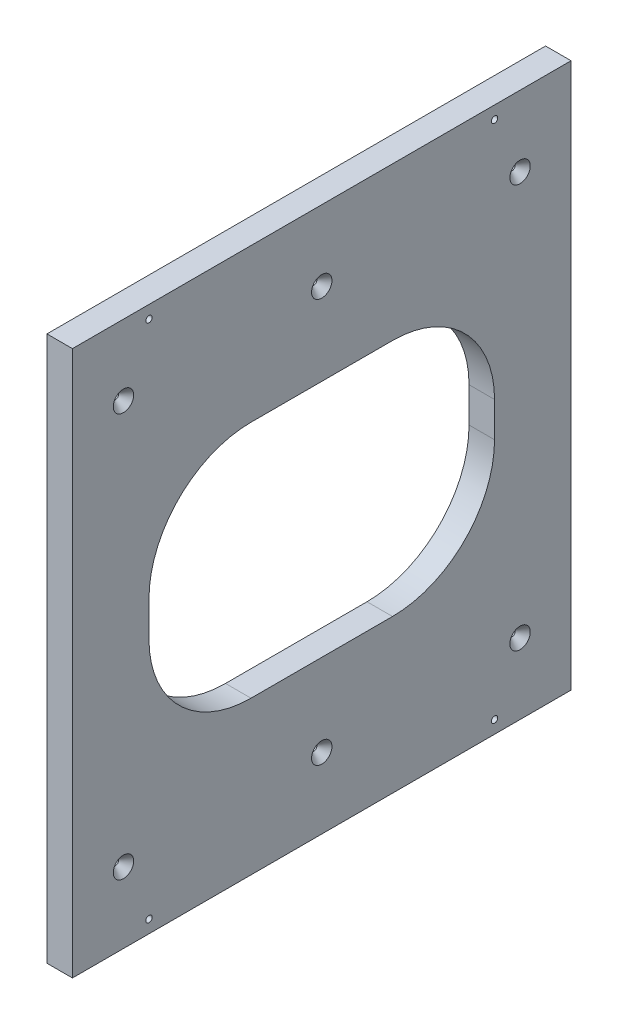
ISO-10303-21;
HEADER;
FILE_DESCRIPTION(('STEP AP214'),'2;1');
FILE_NAME('part.step','',(''),(''),'','','');
FILE_SCHEMA(('AUTOMOTIVE_DESIGN { 1 0 10303 214 1 1 1 1 }'));
ENDSEC;
DATA;
#1=APPLICATION_CONTEXT('core data for automotive mechanical design processes');
#2=APPLICATION_PROTOCOL_DEFINITION('international standard','automotive_design',2000,#1);
#3=PRODUCT_CONTEXT('',#1,'mechanical');
#4=PRODUCT('Part','Part','',(#3));
#5=PRODUCT_RELATED_PRODUCT_CATEGORY('part','',(#4));
#6=PRODUCT_DEFINITION_FORMATION('','',#4);
#7=PRODUCT_DEFINITION_CONTEXT('part definition',#1,'design');
#8=PRODUCT_DEFINITION('design','',#6,#7);
#9=PRODUCT_DEFINITION_SHAPE('','',#8);
#10=(LENGTH_UNIT() NAMED_UNIT(*) SI_UNIT(.MILLI.,.METRE.));
#11=(NAMED_UNIT(*) PLANE_ANGLE_UNIT() SI_UNIT($,.RADIAN.));
#12=(NAMED_UNIT(*) SI_UNIT($,.STERADIAN.) SOLID_ANGLE_UNIT());
#13=UNCERTAINTY_MEASURE_WITH_UNIT(LENGTH_MEASURE(1.E-05),#10,'distance_accuracy_value','');
#14=(GEOMETRIC_REPRESENTATION_CONTEXT(3) GLOBAL_UNCERTAINTY_ASSIGNED_CONTEXT((#13)) GLOBAL_UNIT_ASSIGNED_CONTEXT((#10,
#11,#12)) REPRESENTATION_CONTEXT('',''));
#15=CARTESIAN_POINT('',(0.,0.,0.));
#16=DIRECTION('',(0.,0.,1.));
#17=DIRECTION('',(1.,0.,0.));
#18=AXIS2_PLACEMENT_3D('',#15,#16,#17);
#19=CARTESIAN_POINT('',(-234.752967180651,82.8417413816962,538.962549777206));
#20=DIRECTION('',(1.,0.,0.));
#21=DIRECTION('',(0.,1.,0.));
#22=AXIS2_PLACEMENT_3D('',#19,#20,#21);
#23=PLANE('',#22);
#24=CARTESIAN_POINT('',(-234.752967180651,47.6249999999993,222.849999999992));
#25=DIRECTION('',(1.,0.,0.));
#26=DIRECTION('',(0.,1.,0.));
#27=AXIS2_PLACEMENT_3D('',#24,#25,#26);
#28=CIRCLE('',#27,1.5875);
#29=CARTESIAN_POINT('',(-234.752967180651,49.2124999999993,222.849999999992));
#30=VERTEX_POINT('',#29);
#31=EDGE_CURVE('E39',#30,#30,#28,.T.);
#32=ORIENTED_EDGE('',*,*,#31,.T.);
#33=EDGE_LOOP('',(#32));
#34=FACE_BOUND('',#33,.T.);
#35=CARTESIAN_POINT('',(-234.75296718065,47.6249999999993,25.3999999999961));
#36=DIRECTION('',(1.,0.,0.));
#37=DIRECTION('',(0.,1.,0.));
#38=AXIS2_PLACEMENT_3D('',#35,#36,#37);
#39=CIRCLE('',#38,1.5875);
#40=CARTESIAN_POINT('',(-234.75296718065,49.2124999999993,25.3999999999961));
#41=VERTEX_POINT('',#40);
#42=EDGE_CURVE('E285',#41,#41,#39,.T.);
#43=ORIENTED_EDGE('',*,*,#42,.T.);
#44=EDGE_LOOP('',(#43));
#45=FACE_BOUND('',#44,.T.);
#46=CARTESIAN_POINT('',(-234.75296718065,47.6249999999992,124.124999999994));
#47=DIRECTION('',(1.,0.,0.));
#48=DIRECTION('',(0.,1.,0.));
#49=AXIS2_PLACEMENT_3D('',#46,#47,#48);
#50=CIRCLE('',#49,1.5875);
#51=CARTESIAN_POINT('',(-234.75296718065,49.2124999999992,124.124999999994));
#52=VERTEX_POINT('',#51);
#53=EDGE_CURVE('E281',#52,#52,#50,.T.);
#54=ORIENTED_EDGE('',*,*,#53,.T.);
#55=EDGE_LOOP('',(#54));
#56=FACE_BOUND('',#55,.T.);
#57=CARTESIAN_POINT('',(-234.75296718065,-153.307047382675,124.124999999993));
#58=DIRECTION('',(1.,0.,0.));
#59=DIRECTION('',(0.,1.,0.));
#60=AXIS2_PLACEMENT_3D('',#57,#58,#59);
#61=CIRCLE('',#60,1.58749999999999);
#62=CARTESIAN_POINT('',(-234.75296718065,-151.719547382675,124.124999999993));
#63=VERTEX_POINT('',#62);
#64=EDGE_CURVE('E276',#63,#63,#61,.T.);
#65=ORIENTED_EDGE('',*,*,#64,.T.);
#66=EDGE_LOOP('',(#65));
#67=FACE_BOUND('',#66,.T.);
#68=CARTESIAN_POINT('',(-234.75296718065,-153.307047382674,25.3999999999952));
#69=DIRECTION('',(1.,0.,0.));
#70=DIRECTION('',(0.,1.,0.));
#71=AXIS2_PLACEMENT_3D('',#68,#69,#70);
#72=CIRCLE('',#71,1.58749999999999);
#73=CARTESIAN_POINT('',(-234.75296718065,-151.719547382674,25.3999999999952));
#74=VERTEX_POINT('',#73);
#75=EDGE_CURVE('E271',#74,#74,#72,.T.);
#76=ORIENTED_EDGE('',*,*,#75,.T.);
#77=EDGE_LOOP('',(#76));
#78=FACE_BOUND('',#77,.T.);
#79=CARTESIAN_POINT('',(-234.75296718065,-153.307047382675,222.849999999992));
#80=DIRECTION('',(1.,0.,0.));
#81=DIRECTION('',(0.,1.,0.));
#82=AXIS2_PLACEMENT_3D('',#79,#80,#81);
#83=CIRCLE('',#82,1.58749999999999);
#84=CARTESIAN_POINT('',(-234.75296718065,-151.719547382675,222.849999999992));
#85=VERTEX_POINT('',#84);
#86=EDGE_CURVE('E266',#85,#85,#83,.T.);
#87=ORIENTED_EDGE('',*,*,#86,.T.);
#88=EDGE_LOOP('',(#87));
#89=FACE_BOUND('',#88,.T.);
#90=CARTESIAN_POINT('',(-234.752967180654,76.4917413816946,210.149999999995));
#91=DIRECTION('',(-1.,0.,0.));
#92=DIRECTION('',(0.,0.,1.));
#93=AXIS2_PLACEMENT_3D('',#90,#91,#92);
#94=CIRCLE('',#93,5.08);
#95=CARTESIAN_POINT('',(-234.752967180654,76.4917413816946,215.229999999995));
#96=VERTEX_POINT('',#95);
#97=EDGE_CURVE('E269',#96,#96,#94,.T.);
#98=ORIENTED_EDGE('',*,*,#97,.F.);
#99=EDGE_LOOP('',(#98));
#100=FACE_BOUND('',#99,.T.);
#101=CARTESIAN_POINT('',(-234.752967180653,76.4917413816952,38.1000000000011));
#102=DIRECTION('',(-1.,0.,0.));
#103=DIRECTION('',(0.,0.,1.));
#104=AXIS2_PLACEMENT_3D('',#101,#102,#103);
#105=CIRCLE('',#104,5.08);
#106=CARTESIAN_POINT('',(-234.752967180653,76.4917413816952,43.1800000000012));
#107=VERTEX_POINT('',#106);
#108=EDGE_CURVE('E264',#107,#107,#105,.T.);
#109=ORIENTED_EDGE('',*,*,#108,.F.);
#110=EDGE_LOOP('',(#109));
#111=FACE_BOUND('',#110,.T.);
#112=CARTESIAN_POINT('',(-234.752967180653,-182.17378876437,38.1000000000014));
#113=DIRECTION('',(-1.,0.,0.));
#114=DIRECTION('',(0.,0.,1.));
#115=AXIS2_PLACEMENT_3D('',#112,#113,#114);
#116=CIRCLE('',#115,5.08);
#117=CARTESIAN_POINT('',(-234.752967180653,-182.17378876437,43.1800000000014));
#118=VERTEX_POINT('',#117);
#119=EDGE_CURVE('E259',#118,#118,#116,.T.);
#120=ORIENTED_EDGE('',*,*,#119,.F.);
#121=EDGE_LOOP('',(#120));
#122=FACE_BOUND('',#121,.T.);
#123=CARTESIAN_POINT('',(-234.752967180653,-182.173788764371,210.149999999996));
#124=DIRECTION('',(-1.,0.,0.));
#125=DIRECTION('',(0.,0.,1.));
#126=AXIS2_PLACEMENT_3D('',#123,#124,#125);
#127=CIRCLE('',#126,5.08);
#128=CARTESIAN_POINT('',(-234.752967180653,-182.173788764371,215.229999999996));
#129=VERTEX_POINT('',#128);
#130=EDGE_CURVE('E254',#129,#129,#127,.T.);
#131=ORIENTED_EDGE('',*,*,#130,.F.);
#132=EDGE_LOOP('',(#131));
#133=FACE_BOUND('',#132,.T.);
#134=DIRECTION('',(0.,0.,-1.00000000000001));
#135=VECTOR('',#134,1.);
#136=CARTESIAN_POINT('',(-234.75296718065,6.64174138169597,38.1000000000002));
#137=LINE('',#136,#135);
#138=CARTESIAN_POINT('',(-234.75296718065,6.64174138169605,159.349999999995));
#139=VERTEX_POINT('',#138);
#140=CARTESIAN_POINT('',(-234.752967180651,6.64174138169608,88.9000000000002));
#141=VERTEX_POINT('',#140);
#142=EDGE_CURVE('E177',#139,#141,#137,.T.);
#143=ORIENTED_EDGE('',*,*,#142,.F.);
#144=CARTESIAN_POINT('',(-234.752967180651,-44.1582586183039,159.349999999997));
#145=DIRECTION('',(1.,0.,0.));
#146=DIRECTION('',(0.,1.,0.));
#147=AXIS2_PLACEMENT_3D('',#144,#145,#146);
#148=CIRCLE('',#147,50.8);
#149=CARTESIAN_POINT('',(-234.752967180651,-44.1582586183039,210.149999999997));
#150=VERTEX_POINT('',#149);
#151=EDGE_CURVE('E44',#139,#150,#148,.T.);
#152=ORIENTED_EDGE('',*,*,#151,.T.);
#153=DIRECTION('',(0.,1.,0.));
#154=VECTOR('',#153,1.);
#155=CARTESIAN_POINT('',(-234.75296718065,-112.323788764369,210.149999999997));
#156=LINE('',#155,#154);
#157=CARTESIAN_POINT('',(-234.752967180651,-61.5237887643692,210.149999999994));
#158=VERTEX_POINT('',#157);
#159=EDGE_CURVE('E175',#158,#150,#156,.T.);
#160=ORIENTED_EDGE('',*,*,#159,.F.);
#161=CARTESIAN_POINT('',(-234.752967180651,-61.5237887643692,159.349999999996));
#162=DIRECTION('',(1.,0.,0.));
#163=DIRECTION('',(0.,1.,0.));
#164=AXIS2_PLACEMENT_3D('',#161,#162,#163);
#165=CIRCLE('',#164,50.8);
#166=CARTESIAN_POINT('',(-234.752967180652,-112.323788764369,159.349999999997));
#167=VERTEX_POINT('',#166);
#168=EDGE_CURVE('E243',#158,#167,#165,.T.);
#169=ORIENTED_EDGE('',*,*,#168,.T.);
#170=DIRECTION('',(0.,0.,1.00000000000001));
#171=VECTOR('',#170,1.);
#172=CARTESIAN_POINT('',(-234.75296718065,-112.323788764369,38.1000000000009));
#173=LINE('',#172,#171);
#174=CARTESIAN_POINT('',(-234.752967180651,-112.323788764369,88.9000000000009));
#175=VERTEX_POINT('',#174);
#176=EDGE_CURVE('E166',#175,#167,#173,.T.);
#177=ORIENTED_EDGE('',*,*,#176,.F.);
#178=CARTESIAN_POINT('',(-234.75296718065,-61.5237887643692,88.8999999999997));
#179=DIRECTION('',(1.,0.,0.));
#180=DIRECTION('',(0.,1.,0.));
#181=AXIS2_PLACEMENT_3D('',#178,#179,#180);
#182=CIRCLE('',#181,50.8);
#183=CARTESIAN_POINT('',(-234.752967180651,-61.5237887643694,38.0999999999991));
#184=VERTEX_POINT('',#183);
#185=EDGE_CURVE('E239',#175,#184,#182,.T.);
#186=ORIENTED_EDGE('',*,*,#185,.T.);
#187=DIRECTION('',(0.,-1.,0.));
#188=VECTOR('',#187,1.);
#189=CARTESIAN_POINT('',(-234.75296718065,-112.323788764369,38.1000000000009));
#190=LINE('',#189,#188);
#191=CARTESIAN_POINT('',(-234.752967180651,-44.1582586183041,38.1000000000009));
#192=VERTEX_POINT('',#191);
#193=EDGE_CURVE('E180',#192,#184,#190,.T.);
#194=ORIENTED_EDGE('',*,*,#193,.F.);
#195=CARTESIAN_POINT('',(-234.752967180651,-44.1582586183039,88.9000000000009));
#196=DIRECTION('',(1.,0.,0.));
#197=DIRECTION('',(0.,1.,0.));
#198=AXIS2_PLACEMENT_3D('',#195,#196,#197);
#199=CIRCLE('',#198,50.8);
#200=EDGE_CURVE('E235',#192,#141,#199,.T.);
#201=ORIENTED_EDGE('',*,*,#200,.T.);
#202=EDGE_LOOP('',(#143,#152,#160,#169,#177,#186,#194,#201));
#203=FACE_BOUND('',#202,.T.);
#204=DIRECTION('',(0.,-1.,0.));
#205=VECTOR('',#204,1.);
#206=CARTESIAN_POINT('',(-234.752967180651,82.8417413816956,248.249999999995));
#207=LINE('',#206,#205);
#208=CARTESIAN_POINT('',(-234.752967180651,82.8417413816962,248.249999999995));
#209=VERTEX_POINT('',#208);
#210=CARTESIAN_POINT('',(-234.752967180651,-188.523788764369,248.249999999996));
#211=VERTEX_POINT('',#210);
#212=EDGE_CURVE('E208',#209,#211,#207,.T.);
#213=ORIENTED_EDGE('',*,*,#212,.F.);
#214=DIRECTION('',(0.,0.,-1.));
#215=VECTOR('',#214,1.);
#216=CARTESIAN_POINT('',(-234.752967180651,82.8417413816962,538.962549777206));
#217=LINE('',#216,#215);
#218=CARTESIAN_POINT('',(-234.75296718065,82.8417413816961,-8.88178419700125E-13));
#219=VERTEX_POINT('',#218);
#220=EDGE_CURVE('E174',#209,#219,#217,.T.);
#221=ORIENTED_EDGE('',*,*,#220,.T.);
#222=DIRECTION('',(0.,-1.,0.));
#223=VECTOR('',#222,1.);
#224=CARTESIAN_POINT('',(-234.75296718065,82.8417413816961,-8.88178419700125E-13));
#225=LINE('',#224,#223);
#226=CARTESIAN_POINT('',(-234.752967180651,-188.523788764369,6.66133814775094E-13));
#227=VERTEX_POINT('',#226);
#228=EDGE_CURVE('E198',#219,#227,#225,.T.);
#229=ORIENTED_EDGE('',*,*,#228,.T.);
#230=DIRECTION('',(0.,0.,-1.));
#231=VECTOR('',#230,1.);
#232=CARTESIAN_POINT('',(-234.752967180653,-188.523788764369,538.962549777207));
#233=LINE('',#232,#231);
#234=EDGE_CURVE('E197',#211,#227,#233,.T.);
#235=ORIENTED_EDGE('',*,*,#234,.F.);
#236=EDGE_LOOP('',(#213,#221,#229,#235));
#237=FACE_BOUND('',#236,.T.);
#238=ADVANCED_FACE('F35',(#34,#45,#56,#67,#78,#89,#100,#111,#122,#133,#203,#237),#23,.F.);
#239=CARTESIAN_POINT('',(-234.752967180653,-188.523788764369,538.962549777207));
#240=DIRECTION('',(0.,1.,0.));
#241=DIRECTION('',(0.,0.,1.));
#242=AXIS2_PLACEMENT_3D('',#239,#240,#241);
#243=PLANE('',#242);
#244=DIRECTION('',(1.,0.,0.));
#245=VECTOR('',#244,1.);
#246=CARTESIAN_POINT('',(-234.752967180648,-188.523788764369,248.249999999996));
#247=LINE('',#246,#245);
#248=CARTESIAN_POINT('',(-222.052967180651,-188.523788764369,248.249999999996));
#249=VERTEX_POINT('',#248);
#250=EDGE_CURVE('E205',#211,#249,#247,.T.);
#251=ORIENTED_EDGE('',*,*,#250,.F.);
#252=ORIENTED_EDGE('',*,*,#234,.T.);
#253=DIRECTION('',(1.,0.,0.));
#254=VECTOR('',#253,1.);
#255=CARTESIAN_POINT('',(-234.752967180651,-188.523788764369,6.66133814775094E-13));
#256=LINE('',#255,#254);
#257=CARTESIAN_POINT('',(-222.05296718065,-188.523788764369,0.));
#258=VERTEX_POINT('',#257);
#259=EDGE_CURVE('E194',#227,#258,#256,.T.);
#260=ORIENTED_EDGE('',*,*,#259,.T.);
#261=DIRECTION('',(0.,0.,-1.));
#262=VECTOR('',#261,1.);
#263=CARTESIAN_POINT('',(-222.052967180651,-188.523788764369,538.962549777205));
#264=LINE('',#263,#262);
#265=EDGE_CURVE('E193',#249,#258,#264,.T.);
#266=ORIENTED_EDGE('',*,*,#265,.F.);
#267=EDGE_LOOP('',(#251,#252,#260,#266));
#268=FACE_BOUND('',#267,.T.);
#269=ADVANCED_FACE('F348',(#268),#243,.F.);
#270=CARTESIAN_POINT('',(-222.052967180652,82.8417413816962,538.962549777205));
#271=DIRECTION('',(-1.,0.,0.));
#272=DIRECTION('',(0.,-1.,0.));
#273=AXIS2_PLACEMENT_3D('',#270,#271,#272);
#274=PLANE('',#273);
#275=CARTESIAN_POINT('',(-222.052967180653,47.6249999999992,222.849999999992));
#276=DIRECTION('',(1.,0.,0.));
#277=DIRECTION('',(0.,0.,-1.));
#278=AXIS2_PLACEMENT_3D('',#275,#276,#277);
#279=CIRCLE('',#278,5.08);
#280=CARTESIAN_POINT('',(-222.052967180653,47.6249999999992,217.769999999992));
#281=VERTEX_POINT('',#280);
#282=EDGE_CURVE('E434',#281,#281,#279,.T.);
#283=ORIENTED_EDGE('',*,*,#282,.F.);
#284=EDGE_LOOP('',(#283));
#285=FACE_BOUND('',#284,.T.);
#286=CARTESIAN_POINT('',(-222.052967180654,47.624999999999,25.3999999999959));
#287=DIRECTION('',(1.,0.,0.));
#288=DIRECTION('',(0.,0.,-1.));
#289=AXIS2_PLACEMENT_3D('',#286,#287,#288);
#290=CIRCLE('',#289,5.08);
#291=CARTESIAN_POINT('',(-222.052967180654,47.624999999999,20.3199999999958));
#292=VERTEX_POINT('',#291);
#293=EDGE_CURVE('E294',#292,#292,#290,.T.);
#294=ORIENTED_EDGE('',*,*,#293,.F.);
#295=EDGE_LOOP('',(#294));
#296=FACE_BOUND('',#295,.T.);
#297=CARTESIAN_POINT('',(-222.052967180653,47.6249999999993,124.124999999994));
#298=DIRECTION('',(1.,0.,0.));
#299=DIRECTION('',(0.,0.,-1.));
#300=AXIS2_PLACEMENT_3D('',#297,#298,#299);
#301=CIRCLE('',#300,5.08);
#302=CARTESIAN_POINT('',(-222.052967180653,47.6249999999993,119.044999999994));
#303=VERTEX_POINT('',#302);
#304=EDGE_CURVE('E287',#303,#303,#301,.T.);
#305=ORIENTED_EDGE('',*,*,#304,.F.);
#306=EDGE_LOOP('',(#305));
#307=FACE_BOUND('',#306,.T.);
#308=CARTESIAN_POINT('',(-222.052967180653,-153.307047382674,124.124999999993));
#309=DIRECTION('',(1.,0.,0.));
#310=DIRECTION('',(0.,0.,-1.));
#311=AXIS2_PLACEMENT_3D('',#308,#309,#310);
#312=CIRCLE('',#311,5.08);
#313=CARTESIAN_POINT('',(-222.052967180653,-153.307047382674,119.044999999993));
#314=VERTEX_POINT('',#313);
#315=EDGE_CURVE('E283',#314,#314,#312,.T.);
#316=ORIENTED_EDGE('',*,*,#315,.F.);
#317=EDGE_LOOP('',(#316));
#318=FACE_BOUND('',#317,.T.);
#319=CARTESIAN_POINT('',(-222.052967180653,-153.307047382674,25.3999999999954));
#320=DIRECTION('',(1.,0.,0.));
#321=DIRECTION('',(0.,0.,-1.));
#322=AXIS2_PLACEMENT_3D('',#319,#320,#321);
#323=CIRCLE('',#322,5.08);
#324=CARTESIAN_POINT('',(-222.052967180653,-153.307047382674,20.3199999999954));
#325=VERTEX_POINT('',#324);
#326=EDGE_CURVE('E279',#325,#325,#323,.T.);
#327=ORIENTED_EDGE('',*,*,#326,.F.);
#328=EDGE_LOOP('',(#327));
#329=FACE_BOUND('',#328,.T.);
#330=CARTESIAN_POINT('',(-222.052967180653,-153.307047382674,222.849999999991));
#331=DIRECTION('',(1.,0.,0.));
#332=DIRECTION('',(0.,0.,-1.));
#333=AXIS2_PLACEMENT_3D('',#330,#331,#332);
#334=CIRCLE('',#333,5.08);
#335=CARTESIAN_POINT('',(-222.052967180653,-153.307047382674,217.769999999991));
#336=VERTEX_POINT('',#335);
#337=EDGE_CURVE('E274',#336,#336,#334,.T.);
#338=ORIENTED_EDGE('',*,*,#337,.F.);
#339=EDGE_LOOP('',(#338));
#340=FACE_BOUND('',#339,.T.);
#341=CARTESIAN_POINT('',(-222.05296718065,76.4917413816949,210.149999999996));
#342=DIRECTION('',(-1.,0.,0.));
#343=DIRECTION('',(0.,-1.,0.));
#344=AXIS2_PLACEMENT_3D('',#341,#342,#343);
#345=CIRCLE('',#344,1.58750000000001);
#346=CARTESIAN_POINT('',(-222.05296718065,74.9042413816949,210.149999999996));
#347=VERTEX_POINT('',#346);
#348=EDGE_CURVE('E261',#347,#347,#345,.T.);
#349=ORIENTED_EDGE('',*,*,#348,.T.);
#350=EDGE_LOOP('',(#349));
#351=FACE_BOUND('',#350,.T.);
#352=CARTESIAN_POINT('',(-222.052967180651,76.491741381695,38.1000000000005));
#353=DIRECTION('',(-1.,0.,0.));
#354=DIRECTION('',(0.,-1.,0.));
#355=AXIS2_PLACEMENT_3D('',#352,#353,#354);
#356=CIRCLE('',#355,1.58750000000001);
#357=CARTESIAN_POINT('',(-222.052967180651,74.904241381695,38.1000000000005));
#358=VERTEX_POINT('',#357);
#359=EDGE_CURVE('E256',#358,#358,#356,.T.);
#360=ORIENTED_EDGE('',*,*,#359,.T.);
#361=EDGE_LOOP('',(#360));
#362=FACE_BOUND('',#361,.T.);
#363=CARTESIAN_POINT('',(-222.052967180651,-182.17378876437,38.1000000000014));
#364=DIRECTION('',(-1.,0.,0.));
#365=DIRECTION('',(0.,-1.,0.));
#366=AXIS2_PLACEMENT_3D('',#363,#364,#365);
#367=CIRCLE('',#366,1.58749999999999);
#368=CARTESIAN_POINT('',(-222.052967180651,-183.76128876437,38.1000000000014));
#369=VERTEX_POINT('',#368);
#370=EDGE_CURVE('E251',#369,#369,#367,.T.);
#371=ORIENTED_EDGE('',*,*,#370,.T.);
#372=EDGE_LOOP('',(#371));
#373=FACE_BOUND('',#372,.T.);
#374=CARTESIAN_POINT('',(-222.05296718065,-182.17378876437,210.149999999996));
#375=DIRECTION('',(-1.,0.,0.));
#376=DIRECTION('',(0.,-1.,0.));
#377=AXIS2_PLACEMENT_3D('',#374,#375,#376);
#378=CIRCLE('',#377,1.58749999999999);
#379=CARTESIAN_POINT('',(-222.05296718065,-183.76128876437,210.149999999996));
#380=VERTEX_POINT('',#379);
#381=EDGE_CURVE('E145',#380,#380,#378,.T.);
#382=ORIENTED_EDGE('',*,*,#381,.T.);
#383=EDGE_LOOP('',(#382));
#384=FACE_BOUND('',#383,.T.);
#385=DIRECTION('',(0.,-1.,0.));
#386=VECTOR('',#385,1.);
#387=CARTESIAN_POINT('',(-222.05296718065,-112.323788764369,38.1000000000009));
#388=LINE('',#387,#386);
#389=CARTESIAN_POINT('',(-222.052967180651,-44.1582586183041,38.1000000000009));
#390=VERTEX_POINT('',#389);
#391=CARTESIAN_POINT('',(-222.05296718065,-61.5237887643694,38.0999999999996));
#392=VERTEX_POINT('',#391);
#393=EDGE_CURVE('E169',#390,#392,#388,.T.);
#394=ORIENTED_EDGE('',*,*,#393,.T.);
#395=CARTESIAN_POINT('',(-222.052967180651,-61.5237887643694,88.8999999999995));
#396=DIRECTION('',(-1.,0.,0.));
#397=DIRECTION('',(0.,-1.,0.));
#398=AXIS2_PLACEMENT_3D('',#395,#396,#397);
#399=CIRCLE('',#398,50.8);
#400=CARTESIAN_POINT('',(-222.052967180651,-112.323788764369,88.9000000000006));
#401=VERTEX_POINT('',#400);
#402=EDGE_CURVE('E241',#392,#401,#399,.T.);
#403=ORIENTED_EDGE('',*,*,#402,.T.);
#404=DIRECTION('',(0.,0.,1.00000000000001));
#405=VECTOR('',#404,1.);
#406=CARTESIAN_POINT('',(-222.05296718065,-112.323788764369,38.1000000000009));
#407=LINE('',#406,#405);
#408=CARTESIAN_POINT('',(-222.052967180651,-112.323788764369,159.349999999997));
#409=VERTEX_POINT('',#408);
#410=EDGE_CURVE('E172',#401,#409,#407,.T.);
#411=ORIENTED_EDGE('',*,*,#410,.T.);
#412=CARTESIAN_POINT('',(-222.052967180651,-61.5237887643694,159.349999999995));
#413=DIRECTION('',(-1.,0.,0.));
#414=DIRECTION('',(0.,-1.,0.));
#415=AXIS2_PLACEMENT_3D('',#412,#413,#414);
#416=CIRCLE('',#415,50.8);
#417=CARTESIAN_POINT('',(-222.052967180651,-61.5237887643693,210.149999999995));
#418=VERTEX_POINT('',#417);
#419=EDGE_CURVE('E59',#409,#418,#416,.T.);
#420=ORIENTED_EDGE('',*,*,#419,.T.);
#421=DIRECTION('',(0.,1.,0.));
#422=VECTOR('',#421,1.);
#423=CARTESIAN_POINT('',(-222.052967180651,-112.323788764369,210.149999999997));
#424=LINE('',#423,#422);
#425=CARTESIAN_POINT('',(-222.052967180651,-44.158258618304,210.149999999997));
#426=VERTEX_POINT('',#425);
#427=EDGE_CURVE('E163',#418,#426,#424,.T.);
#428=ORIENTED_EDGE('',*,*,#427,.T.);
#429=CARTESIAN_POINT('',(-222.05296718065,-44.1582586183041,159.349999999997));
#430=DIRECTION('',(-1.,0.,0.));
#431=DIRECTION('',(0.,-1.,0.));
#432=AXIS2_PLACEMENT_3D('',#429,#430,#431);
#433=CIRCLE('',#432,50.8);
#434=CARTESIAN_POINT('',(-222.05296718065,6.64174138169594,159.349999999996));
#435=VERTEX_POINT('',#434);
#436=EDGE_CURVE('E11',#426,#435,#433,.T.);
#437=ORIENTED_EDGE('',*,*,#436,.T.);
#438=DIRECTION('',(0.,0.,-1.00000000000001));
#439=VECTOR('',#438,1.);
#440=CARTESIAN_POINT('',(-222.052967180651,6.64174138169605,38.0999999999991));
#441=LINE('',#440,#439);
#442=CARTESIAN_POINT('',(-222.052967180651,6.64174138169606,88.8999999999993));
#443=VERTEX_POINT('',#442);
#444=EDGE_CURVE('E165',#435,#443,#441,.T.);
#445=ORIENTED_EDGE('',*,*,#444,.T.);
#446=CARTESIAN_POINT('',(-222.052967180651,-44.1582586183041,88.9000000000006));
#447=DIRECTION('',(-1.,0.,0.));
#448=DIRECTION('',(0.,-1.,0.));
#449=AXIS2_PLACEMENT_3D('',#446,#447,#448);
#450=CIRCLE('',#449,50.8);
#451=EDGE_CURVE('E237',#443,#390,#450,.T.);
#452=ORIENTED_EDGE('',*,*,#451,.T.);
#453=EDGE_LOOP('',(#394,#403,#411,#420,#428,#437,#445,#452));
#454=FACE_BOUND('',#453,.T.);
#455=DIRECTION('',(0.,1.,0.));
#456=VECTOR('',#455,1.);
#457=CARTESIAN_POINT('',(-222.052967180651,82.8417413816958,248.249999999995));
#458=LINE('',#457,#456);
#459=CARTESIAN_POINT('',(-222.052967180651,82.8417413816963,248.249999999995));
#460=VERTEX_POINT('',#459);
#461=EDGE_CURVE('E201',#249,#460,#458,.T.);
#462=ORIENTED_EDGE('',*,*,#461,.F.);
#463=ORIENTED_EDGE('',*,*,#265,.T.);
#464=DIRECTION('',(0.,1.,0.));
#465=VECTOR('',#464,1.);
#466=CARTESIAN_POINT('',(-222.052967180652,82.8417413816957,-2.88657986402541E-12));
#467=LINE('',#466,#465);
#468=CARTESIAN_POINT('',(-222.052967180652,82.8417413816957,-2.88657986402541E-12));
#469=VERTEX_POINT('',#468);
#470=EDGE_CURVE('E190',#258,#469,#467,.T.);
#471=ORIENTED_EDGE('',*,*,#470,.T.);
#472=DIRECTION('',(0.,0.,-1.));
#473=VECTOR('',#472,1.);
#474=CARTESIAN_POINT('',(-222.052967180652,82.8417413816962,538.962549777205));
#475=LINE('',#474,#473);
#476=EDGE_CURVE('E189',#460,#469,#475,.T.);
#477=ORIENTED_EDGE('',*,*,#476,.F.);
#478=EDGE_LOOP('',(#462,#463,#471,#477));
#479=FACE_BOUND('',#478,.T.);
#480=ADVANCED_FACE('F354',(#285,#296,#307,#318,#329,#340,#351,#362,#373,#384,#454,#479),#274,.F.);
#481=CARTESIAN_POINT('',(-234.752967180651,82.8417413816962,538.962549777206));
#482=DIRECTION('',(0.,-1.,0.));
#483=DIRECTION('',(0.,0.,-1.));
#484=AXIS2_PLACEMENT_3D('',#481,#482,#483);
#485=PLANE('',#484);
#486=DIRECTION('',(-1.,0.,0.));
#487=VECTOR('',#486,1.);
#488=CARTESIAN_POINT('',(-234.752967180648,82.8417413816962,248.249999999995));
#489=LINE('',#488,#487);
#490=EDGE_CURVE('E188',#460,#209,#489,.T.);
#491=ORIENTED_EDGE('',*,*,#490,.F.);
#492=ORIENTED_EDGE('',*,*,#476,.T.);
#493=DIRECTION('',(-1.,0.,0.));
#494=VECTOR('',#493,1.);
#495=CARTESIAN_POINT('',(-234.75296718065,82.8417413816961,-8.88178419700125E-13));
#496=LINE('',#495,#494);
#497=EDGE_CURVE('E185',#469,#219,#496,.T.);
#498=ORIENTED_EDGE('',*,*,#497,.T.);
#499=ORIENTED_EDGE('',*,*,#220,.F.);
#500=EDGE_LOOP('',(#491,#492,#498,#499));
#501=FACE_BOUND('',#500,.T.);
#502=ADVANCED_FACE('F423',(#501),#485,.F.);
#503=CARTESIAN_POINT('',(0.,0.,0.));
#504=DIRECTION('',(0.,0.,1.));
#505=DIRECTION('',(1.,0.,0.));
#506=AXIS2_PLACEMENT_3D('',#503,#504,#505);
#507=PLANE('',#506);
#508=CARTESIAN_POINT('',(-228.402967180651,57.4417413816917,4.44089209850063E-13));
#509=DIRECTION('',(0.,0.,1.));
#510=DIRECTION('',(1.,0.,0.));
#511=AXIS2_PLACEMENT_3D('',#508,#509,#510);
#512=CIRCLE('',#511,1.58749999999999);
#513=CARTESIAN_POINT('',(-226.815467180651,57.4417413816917,4.40652375699457E-13));
#514=VERTEX_POINT('',#513);
#515=EDGE_CURVE('E144',#514,#514,#512,.T.);
#516=ORIENTED_EDGE('',*,*,#515,.T.);
#517=EDGE_LOOP('',(#516));
#518=FACE_BOUND('',#517,.T.);
#519=CARTESIAN_POINT('',(-228.402967180652,-52.8410236913407,-2.22044604925031E-13));
#520=DIRECTION('',(0.,0.,1.));
#521=DIRECTION('',(1.,0.,0.));
#522=AXIS2_PLACEMENT_3D('',#519,#520,#521);
#523=CIRCLE('',#522,1.58749999999999);
#524=CARTESIAN_POINT('',(-226.815467180652,-52.8410236913407,-2.25481439075637E-13));
#525=VERTEX_POINT('',#524);
#526=EDGE_CURVE('E158',#525,#525,#523,.T.);
#527=ORIENTED_EDGE('',*,*,#526,.T.);
#528=EDGE_LOOP('',(#527));
#529=FACE_BOUND('',#528,.T.);
#530=CARTESIAN_POINT('',(-228.402967180651,-163.123788764374,2.22044604925031E-13));
#531=DIRECTION('',(0.,0.,1.));
#532=DIRECTION('',(1.,0.,0.));
#533=AXIS2_PLACEMENT_3D('',#530,#531,#532);
#534=CIRCLE('',#533,1.58749999999999);
#535=CARTESIAN_POINT('',(-226.815467180651,-163.123788764374,2.18607770774426E-13));
#536=VERTEX_POINT('',#535);
#537=EDGE_CURVE('E162',#536,#536,#534,.T.);
#538=ORIENTED_EDGE('',*,*,#537,.T.);
#539=EDGE_LOOP('',(#538));
#540=FACE_BOUND('',#539,.T.);
#541=ORIENTED_EDGE('',*,*,#228,.F.);
#542=ORIENTED_EDGE('',*,*,#497,.F.);
#543=ORIENTED_EDGE('',*,*,#470,.F.);
#544=ORIENTED_EDGE('',*,*,#259,.F.);
#545=EDGE_LOOP('',(#541,#542,#543,#544));
#546=FACE_BOUND('',#545,.T.);
#547=ADVANCED_FACE('F364',(#518,#529,#540,#546),#507,.F.);
#548=CARTESIAN_POINT('',(-234.752967180649,19.0500000000003,248.249999999995));
#549=DIRECTION('',(0.,0.,1.00000000000001));
#550=DIRECTION('',(-1.,0.,0.));
#551=AXIS2_PLACEMENT_3D('',#548,#549,#550);
#552=PLANE('',#551);
#553=ORIENTED_EDGE('',*,*,#490,.T.);
#554=ORIENTED_EDGE('',*,*,#212,.T.);
#555=ORIENTED_EDGE('',*,*,#250,.T.);
#556=ORIENTED_EDGE('',*,*,#461,.T.);
#557=EDGE_LOOP('',(#553,#554,#555,#556));
#558=FACE_BOUND('',#557,.T.);
#559=ADVANCED_FACE('F360',(#558),#552,.T.);
#560=CARTESIAN_POINT('',(-222.052967180651,-112.323788764369,210.149999999997));
#561=DIRECTION('',(0.,0.,1.00000000000001));
#562=DIRECTION('',(1.,0.,0.));
#563=AXIS2_PLACEMENT_3D('',#560,#561,#562);
#564=PLANE('',#563);
#565=ORIENTED_EDGE('',*,*,#427,.F.);
#566=DIRECTION('',(-1.,0.,0.));
#567=VECTOR('',#566,1.);
#568=CARTESIAN_POINT('',(-234.752967180651,-61.5237887643692,210.149999999994));
#569=LINE('',#568,#567);
#570=EDGE_CURVE('E232',#418,#158,#569,.T.);
#571=ORIENTED_EDGE('',*,*,#570,.T.);
#572=ORIENTED_EDGE('',*,*,#159,.T.);
#573=DIRECTION('',(-1.,0.,0.));
#574=VECTOR('',#573,1.);
#575=CARTESIAN_POINT('',(-222.052967180651,-44.158258618304,210.149999999997));
#576=LINE('',#575,#574);
#577=EDGE_CURVE('E52',#150,#426,#576,.F.);
#578=ORIENTED_EDGE('',*,*,#577,.T.);
#579=EDGE_LOOP('',(#565,#571,#572,#578));
#580=FACE_BOUND('',#579,.T.);
#581=ADVANCED_FACE('F363',(#580),#564,.F.);
#582=CARTESIAN_POINT('',(-222.05296718065,-112.323788764369,38.1000000000009));
#583=DIRECTION('',(0.,-1.,0.));
#584=DIRECTION('',(1.,0.,0.));
#585=AXIS2_PLACEMENT_3D('',#582,#583,#584);
#586=PLANE('',#585);
#587=ORIENTED_EDGE('',*,*,#410,.F.);
#588=DIRECTION('',(-1.,0.,0.));
#589=VECTOR('',#588,1.);
#590=CARTESIAN_POINT('',(-234.752967180651,-112.323788764369,88.9000000000009));
#591=LINE('',#590,#589);
#592=EDGE_CURVE('E228',#401,#175,#591,.T.);
#593=ORIENTED_EDGE('',*,*,#592,.T.);
#594=ORIENTED_EDGE('',*,*,#176,.T.);
#595=DIRECTION('',(-1.,0.,0.));
#596=VECTOR('',#595,1.);
#597=CARTESIAN_POINT('',(-222.052967180651,-112.323788764369,159.349999999997));
#598=LINE('',#597,#596);
#599=EDGE_CURVE('E226',#167,#409,#598,.F.);
#600=ORIENTED_EDGE('',*,*,#599,.T.);
#601=EDGE_LOOP('',(#587,#593,#594,#600));
#602=FACE_BOUND('',#601,.T.);
#603=ADVANCED_FACE('F406',(#602),#586,.F.);
#604=CARTESIAN_POINT('',(-222.05296718065,-112.323788764369,38.1000000000009));
#605=DIRECTION('',(0.,0.,-1.00000000000001));
#606=DIRECTION('',(-1.,0.,0.));
#607=AXIS2_PLACEMENT_3D('',#604,#605,#606);
#608=PLANE('',#607);
#609=ORIENTED_EDGE('',*,*,#393,.F.);
#610=DIRECTION('',(-1.,0.,0.));
#611=VECTOR('',#610,1.);
#612=CARTESIAN_POINT('',(-234.752967180651,-44.1582586183041,38.1000000000009));
#613=LINE('',#612,#611);
#614=EDGE_CURVE('E218',#390,#192,#613,.T.);
#615=ORIENTED_EDGE('',*,*,#614,.T.);
#616=ORIENTED_EDGE('',*,*,#193,.T.);
#617=DIRECTION('',(-1.,0.,0.));
#618=VECTOR('',#617,1.);
#619=CARTESIAN_POINT('',(-222.05296718065,-61.5237887643694,38.0999999999996));
#620=LINE('',#619,#618);
#621=EDGE_CURVE('E204',#184,#392,#620,.F.);
#622=ORIENTED_EDGE('',*,*,#621,.T.);
#623=EDGE_LOOP('',(#609,#615,#616,#622));
#624=FACE_BOUND('',#623,.T.);
#625=ADVANCED_FACE('F400',(#624),#608,.F.);
#626=CARTESIAN_POINT('',(-222.052967180651,6.64174138169605,38.0999999999991));
#627=DIRECTION('',(0.,1.,0.));
#628=DIRECTION('',(-1.,0.,0.));
#629=AXIS2_PLACEMENT_3D('',#626,#627,#628);
#630=PLANE('',#629);
#631=ORIENTED_EDGE('',*,*,#142,.T.);
#632=DIRECTION('',(-1.,0.,0.));
#633=VECTOR('',#632,1.);
#634=CARTESIAN_POINT('',(-222.052967180651,6.64174138169606,88.8999999999993));
#635=LINE('',#634,#633);
#636=EDGE_CURVE('E224',#141,#443,#635,.F.);
#637=ORIENTED_EDGE('',*,*,#636,.T.);
#638=ORIENTED_EDGE('',*,*,#444,.F.);
#639=DIRECTION('',(-1.,0.,0.));
#640=VECTOR('',#639,1.);
#641=CARTESIAN_POINT('',(-234.75296718065,6.64174138169605,159.349999999995));
#642=LINE('',#641,#640);
#643=EDGE_CURVE('E221',#435,#139,#642,.T.);
#644=ORIENTED_EDGE('',*,*,#643,.T.);
#645=EDGE_LOOP('',(#631,#637,#638,#644));
#646=FACE_BOUND('',#645,.T.);
#647=ADVANCED_FACE('F370',(#646),#630,.F.);
#648=CARTESIAN_POINT('',(-222.052967180651,-44.1582586183041,88.9000000000006));
#649=DIRECTION('',(1.,0.,0.));
#650=DIRECTION('',(0.,1.,0.));
#651=AXIS2_PLACEMENT_3D('',#648,#649,#650);
#652=CYLINDRICAL_SURFACE('',#651,50.8);
#653=ORIENTED_EDGE('',*,*,#451,.F.);
#654=ORIENTED_EDGE('',*,*,#636,.F.);
#655=ORIENTED_EDGE('',*,*,#200,.F.);
#656=ORIENTED_EDGE('',*,*,#614,.F.);
#657=EDGE_LOOP('',(#653,#654,#655,#656));
#658=FACE_BOUND('',#657,.T.);
#659=ADVANCED_FACE('F366',(#658),#652,.F.);
#660=CARTESIAN_POINT('',(-222.052967180651,-61.5237887643694,88.8999999999995));
#661=DIRECTION('',(1.,0.,0.));
#662=DIRECTION('',(0.,1.,0.));
#663=AXIS2_PLACEMENT_3D('',#660,#661,#662);
#664=CYLINDRICAL_SURFACE('',#663,50.8);
#665=ORIENTED_EDGE('',*,*,#402,.F.);
#666=ORIENTED_EDGE('',*,*,#621,.F.);
#667=ORIENTED_EDGE('',*,*,#185,.F.);
#668=ORIENTED_EDGE('',*,*,#592,.F.);
#669=EDGE_LOOP('',(#665,#666,#667,#668));
#670=FACE_BOUND('',#669,.T.);
#671=ADVANCED_FACE('F369',(#670),#664,.F.);
#672=CARTESIAN_POINT('',(-222.052967180651,-61.5237887643694,159.349999999995));
#673=DIRECTION('',(1.,0.,0.));
#674=DIRECTION('',(0.,1.,0.));
#675=AXIS2_PLACEMENT_3D('',#672,#673,#674);
#676=CYLINDRICAL_SURFACE('',#675,50.8);
#677=ORIENTED_EDGE('',*,*,#419,.F.);
#678=ORIENTED_EDGE('',*,*,#599,.F.);
#679=ORIENTED_EDGE('',*,*,#168,.F.);
#680=ORIENTED_EDGE('',*,*,#570,.F.);
#681=EDGE_LOOP('',(#677,#678,#679,#680));
#682=FACE_BOUND('',#681,.T.);
#683=ADVANCED_FACE('F373',(#682),#676,.F.);
#684=CARTESIAN_POINT('',(-222.05296718065,-44.1582586183041,159.349999999997));
#685=DIRECTION('',(1.,0.,0.));
#686=DIRECTION('',(0.,1.,0.));
#687=AXIS2_PLACEMENT_3D('',#684,#685,#686);
#688=CYLINDRICAL_SURFACE('',#687,50.8);
#689=ORIENTED_EDGE('',*,*,#436,.F.);
#690=ORIENTED_EDGE('',*,*,#577,.F.);
#691=ORIENTED_EDGE('',*,*,#151,.F.);
#692=ORIENTED_EDGE('',*,*,#643,.F.);
#693=EDGE_LOOP('',(#689,#690,#691,#692));
#694=FACE_BOUND('',#693,.T.);
#695=ADVANCED_FACE('F37',(#694),#688,.F.);
#696=CARTESIAN_POINT('',(-228.402967180651,-163.123788764373,-12.7000000000006));
#697=DIRECTION('',(0.,0.,-1.));
#698=DIRECTION('',(-1.,0.,0.));
#699=AXIS2_PLACEMENT_3D('',#696,#697,#698);
#700=CYLINDRICAL_SURFACE('',#699,1.58749999999999);
#701=CARTESIAN_POINT('',(-228.402967180652,-163.123788764373,19.05));
#702=DIRECTION('',(0.,0.,-1.));
#703=DIRECTION('',(-1.,0.,0.));
#704=AXIS2_PLACEMENT_3D('',#701,#702,#703);
#705=CIRCLE('',#704,1.58749999999999);
#706=CARTESIAN_POINT('',(-229.990467180652,-163.123788764373,19.05));
#707=VERTEX_POINT('',#706);
#708=EDGE_CURVE('E159',#707,#707,#705,.T.);
#709=ORIENTED_EDGE('',*,*,#708,.F.);
#710=EDGE_LOOP('',(#709));
#711=FACE_BOUND('',#710,.T.);
#712=ORIENTED_EDGE('',*,*,#537,.F.);
#713=EDGE_LOOP('',(#712));
#714=FACE_BOUND('',#713,.T.);
#715=ADVANCED_FACE('F380',(#711,#714),#700,.F.);
#716=CARTESIAN_POINT('',(-228.402967180652,-163.123788764373,19.05));
#717=DIRECTION('',(0.,0.,-1.));
#718=DIRECTION('',(-1.,0.,0.));
#719=AXIS2_PLACEMENT_3D('',#716,#717,#718);
#720=CONICAL_SURFACE('',#719,1.58749999999999,1.02974425867665);
#721=CARTESIAN_POINT('',(-228.402967180652,-163.123788764373,20.0038662327062));
#722=VERTEX_POINT('',#721);
#723=VERTEX_LOOP('',#722);
#724=FACE_BOUND('',#723,.T.);
#725=ORIENTED_EDGE('',*,*,#708,.T.);
#726=EDGE_LOOP('',(#725));
#727=FACE_BOUND('',#726,.T.);
#728=ADVANCED_FACE('F416',(#724,#727),#720,.F.);
#729=CARTESIAN_POINT('',(-228.402967180652,-52.8410236913406,-12.700000000001));
#730=DIRECTION('',(0.,0.,-1.));
#731=DIRECTION('',(-1.,0.,0.));
#732=AXIS2_PLACEMENT_3D('',#729,#730,#731);
#733=CYLINDRICAL_SURFACE('',#732,1.58749999999999);
#734=CARTESIAN_POINT('',(-228.402967180651,-52.8410236913406,19.0499999999996));
#735=DIRECTION('',(0.,0.,-1.));
#736=DIRECTION('',(-1.,0.,0.));
#737=AXIS2_PLACEMENT_3D('',#734,#735,#736);
#738=CIRCLE('',#737,1.58749999999999);
#739=CARTESIAN_POINT('',(-229.990467180651,-52.8410236913406,19.0499999999996));
#740=VERTEX_POINT('',#739);
#741=EDGE_CURVE('E148',#740,#740,#738,.T.);
#742=ORIENTED_EDGE('',*,*,#741,.F.);
#743=EDGE_LOOP('',(#742));
#744=FACE_BOUND('',#743,.T.);
#745=ORIENTED_EDGE('',*,*,#526,.F.);
#746=EDGE_LOOP('',(#745));
#747=FACE_BOUND('',#746,.T.);
#748=ADVANCED_FACE('F621',(#744,#747),#733,.F.);
#749=CARTESIAN_POINT('',(-228.402967180651,-52.8410236913406,19.0499999999996));
#750=DIRECTION('',(0.,0.,-1.));
#751=DIRECTION('',(-1.,0.,0.));
#752=AXIS2_PLACEMENT_3D('',#749,#750,#751);
#753=CONICAL_SURFACE('',#752,1.58749999999999,1.02974425867665);
#754=CARTESIAN_POINT('',(-228.402967180652,-52.8410236913407,20.0038662327056));
#755=VERTEX_POINT('',#754);
#756=VERTEX_LOOP('',#755);
#757=FACE_BOUND('',#756,.T.);
#758=ORIENTED_EDGE('',*,*,#741,.T.);
#759=EDGE_LOOP('',(#758));
#760=FACE_BOUND('',#759,.T.);
#761=ADVANCED_FACE('F614',(#757,#760),#753,.F.);
#762=CARTESIAN_POINT('',(-228.402967180652,57.4417413816921,-12.7000000000015));
#763=DIRECTION('',(0.,0.,-1.));
#764=DIRECTION('',(-1.,0.,0.));
#765=AXIS2_PLACEMENT_3D('',#762,#763,#764);
#766=CYLINDRICAL_SURFACE('',#765,1.58749999999999);
#767=CARTESIAN_POINT('',(-228.402967180651,57.4417413816921,19.0499999999996));
#768=DIRECTION('',(0.,0.,-1.));
#769=DIRECTION('',(-1.,0.,0.));
#770=AXIS2_PLACEMENT_3D('',#767,#768,#769);
#771=CIRCLE('',#770,1.58749999999999);
#772=CARTESIAN_POINT('',(-229.990467180651,57.4417413816921,19.0499999999996));
#773=VERTEX_POINT('',#772);
#774=EDGE_CURVE('E142',#773,#773,#771,.T.);
#775=ORIENTED_EDGE('',*,*,#774,.F.);
#776=EDGE_LOOP('',(#775));
#777=FACE_BOUND('',#776,.T.);
#778=ORIENTED_EDGE('',*,*,#515,.F.);
#779=EDGE_LOOP('',(#778));
#780=FACE_BOUND('',#779,.T.);
#781=ADVANCED_FACE('F138',(#777,#780),#766,.F.);
#782=CARTESIAN_POINT('',(-228.402967180651,57.4417413816921,19.0499999999996));
#783=DIRECTION('',(0.,0.,-1.));
#784=DIRECTION('',(-1.,0.,0.));
#785=AXIS2_PLACEMENT_3D('',#782,#783,#784);
#786=CONICAL_SURFACE('',#785,1.58749999999999,1.02974425867665);
#787=CARTESIAN_POINT('',(-228.402967180651,57.4417413816921,20.0038662327051));
#788=VERTEX_POINT('',#787);
#789=VERTEX_LOOP('',#788);
#790=FACE_BOUND('',#789,.T.);
#791=ORIENTED_EDGE('',*,*,#774,.T.);
#792=EDGE_LOOP('',(#791));
#793=FACE_BOUND('',#792,.T.);
#794=ADVANCED_FACE('F134',(#790,#793),#786,.F.);
#795=CARTESIAN_POINT('',(-234.752967180653,-182.173788764371,210.149999999996));
#796=DIRECTION('',(-1.,0.,0.));
#797=DIRECTION('',(0.,0.,1.));
#798=AXIS2_PLACEMENT_3D('',#795,#796,#797);
#799=CYLINDRICAL_SURFACE('',#798,1.58749999999999);
#800=CARTESIAN_POINT('',(-230.735305518434,-182.173788764371,210.149999999996));
#801=DIRECTION('',(-1.,0.,0.));
#802=DIRECTION('',(0.,0.,1.));
#803=AXIS2_PLACEMENT_3D('',#800,#801,#802);
#804=CIRCLE('',#803,1.58749999999999);
#805=CARTESIAN_POINT('',(-230.735305518434,-182.173788764371,211.737499999996));
#806=VERTEX_POINT('',#805);
#807=EDGE_CURVE('E151',#806,#806,#804,.T.);
#808=ORIENTED_EDGE('',*,*,#807,.T.);
#809=EDGE_LOOP('',(#808));
#810=FACE_BOUND('',#809,.T.);
#811=ORIENTED_EDGE('',*,*,#381,.F.);
#812=EDGE_LOOP('',(#811));
#813=FACE_BOUND('',#812,.T.);
#814=ADVANCED_FACE('F137',(#810,#813),#799,.F.);
#815=CARTESIAN_POINT('',(-234.752967180653,-182.173788764371,210.149999999996));
#816=DIRECTION('',(-1.,0.,0.));
#817=DIRECTION('',(0.,0.,1.));
#818=AXIS2_PLACEMENT_3D('',#815,#816,#817);
#819=CONICAL_SURFACE('',#818,5.08,0.715584993317677);
#820=ORIENTED_EDGE('',*,*,#807,.F.);
#821=EDGE_LOOP('',(#820));
#822=FACE_BOUND('',#821,.T.);
#823=ORIENTED_EDGE('',*,*,#130,.T.);
#824=EDGE_LOOP('',(#823));
#825=FACE_BOUND('',#824,.T.);
#826=ADVANCED_FACE('F335',(#822,#825),#819,.F.);
#827=CARTESIAN_POINT('',(-234.752967180653,-182.17378876437,38.1000000000014));
#828=DIRECTION('',(-1.,0.,0.));
#829=DIRECTION('',(0.,0.,1.));
#830=AXIS2_PLACEMENT_3D('',#827,#828,#829);
#831=CYLINDRICAL_SURFACE('',#830,1.58749999999999);
#832=CARTESIAN_POINT('',(-230.735305518433,-182.173788764371,38.1000000000011));
#833=DIRECTION('',(-1.,0.,0.));
#834=DIRECTION('',(0.,0.,1.));
#835=AXIS2_PLACEMENT_3D('',#832,#833,#834);
#836=CIRCLE('',#835,1.58749999999999);
#837=CARTESIAN_POINT('',(-230.735305518433,-182.173788764371,39.6875000000011));
#838=VERTEX_POINT('',#837);
#839=EDGE_CURVE('E255',#838,#838,#836,.T.);
#840=ORIENTED_EDGE('',*,*,#839,.T.);
#841=EDGE_LOOP('',(#840));
#842=FACE_BOUND('',#841,.T.);
#843=ORIENTED_EDGE('',*,*,#370,.F.);
#844=EDGE_LOOP('',(#843));
#845=FACE_BOUND('',#844,.T.);
#846=ADVANCED_FACE('F337',(#842,#845),#831,.F.);
#847=CARTESIAN_POINT('',(-234.752967180653,-182.17378876437,38.1000000000014));
#848=DIRECTION('',(-1.,0.,0.));
#849=DIRECTION('',(0.,0.,1.));
#850=AXIS2_PLACEMENT_3D('',#847,#848,#849);
#851=CONICAL_SURFACE('',#850,5.08,0.715584993317677);
#852=ORIENTED_EDGE('',*,*,#839,.F.);
#853=EDGE_LOOP('',(#852));
#854=FACE_BOUND('',#853,.T.);
#855=ORIENTED_EDGE('',*,*,#119,.T.);
#856=EDGE_LOOP('',(#855));
#857=FACE_BOUND('',#856,.T.);
#858=ADVANCED_FACE('F343',(#854,#857),#851,.F.);
#859=CARTESIAN_POINT('',(-234.752967180653,76.4917413816952,38.1000000000011));
#860=DIRECTION('',(-1.,0.,0.));
#861=DIRECTION('',(0.,0.,1.));
#862=AXIS2_PLACEMENT_3D('',#859,#860,#861);
#863=CYLINDRICAL_SURFACE('',#862,1.58750000000001);
#864=CARTESIAN_POINT('',(-230.735305518434,76.491741381695,38.1));
#865=DIRECTION('',(-1.,0.,0.));
#866=DIRECTION('',(0.,0.,1.));
#867=AXIS2_PLACEMENT_3D('',#864,#865,#866);
#868=CIRCLE('',#867,1.58750000000001);
#869=CARTESIAN_POINT('',(-230.735305518434,76.491741381695,39.6875));
#870=VERTEX_POINT('',#869);
#871=EDGE_CURVE('E260',#870,#870,#868,.T.);
#872=ORIENTED_EDGE('',*,*,#871,.T.);
#873=EDGE_LOOP('',(#872));
#874=FACE_BOUND('',#873,.T.);
#875=ORIENTED_EDGE('',*,*,#359,.F.);
#876=EDGE_LOOP('',(#875));
#877=FACE_BOUND('',#876,.T.);
#878=ADVANCED_FACE('F454',(#874,#877),#863,.F.);
#879=CARTESIAN_POINT('',(-234.752967180653,76.4917413816952,38.1000000000011));
#880=DIRECTION('',(-1.,0.,0.));
#881=DIRECTION('',(0.,0.,1.));
#882=AXIS2_PLACEMENT_3D('',#879,#880,#881);
#883=CONICAL_SURFACE('',#882,5.08,0.715584993317675);
#884=ORIENTED_EDGE('',*,*,#871,.F.);
#885=EDGE_LOOP('',(#884));
#886=FACE_BOUND('',#885,.T.);
#887=ORIENTED_EDGE('',*,*,#108,.T.);
#888=EDGE_LOOP('',(#887));
#889=FACE_BOUND('',#888,.T.);
#890=ADVANCED_FACE('F456',(#886,#889),#883,.F.);
#891=CARTESIAN_POINT('',(-234.752967180654,76.4917413816946,210.149999999995));
#892=DIRECTION('',(-1.,0.,0.));
#893=DIRECTION('',(0.,0.,1.));
#894=AXIS2_PLACEMENT_3D('',#891,#892,#893);
#895=CYLINDRICAL_SURFACE('',#894,1.58750000000001);
#896=CARTESIAN_POINT('',(-230.735305518434,76.491741381695,210.149999999996));
#897=DIRECTION('',(-1.,0.,0.));
#898=DIRECTION('',(0.,0.,1.));
#899=AXIS2_PLACEMENT_3D('',#896,#897,#898);
#900=CIRCLE('',#899,1.58750000000001);
#901=CARTESIAN_POINT('',(-230.735305518434,76.491741381695,211.737499999996));
#902=VERTEX_POINT('',#901);
#903=EDGE_CURVE('E265',#902,#902,#900,.T.);
#904=ORIENTED_EDGE('',*,*,#903,.T.);
#905=EDGE_LOOP('',(#904));
#906=FACE_BOUND('',#905,.T.);
#907=ORIENTED_EDGE('',*,*,#348,.F.);
#908=EDGE_LOOP('',(#907));
#909=FACE_BOUND('',#908,.T.);
#910=ADVANCED_FACE('F463',(#906,#909),#895,.F.);
#911=CARTESIAN_POINT('',(-234.752967180654,76.4917413816946,210.149999999995));
#912=DIRECTION('',(-1.,0.,0.));
#913=DIRECTION('',(0.,0.,1.));
#914=AXIS2_PLACEMENT_3D('',#911,#912,#913);
#915=CONICAL_SURFACE('',#914,5.08,0.715584993317675);
#916=ORIENTED_EDGE('',*,*,#903,.F.);
#917=EDGE_LOOP('',(#916));
#918=FACE_BOUND('',#917,.T.);
#919=ORIENTED_EDGE('',*,*,#97,.T.);
#920=EDGE_LOOP('',(#919));
#921=FACE_BOUND('',#920,.T.);
#922=ADVANCED_FACE('F471',(#918,#921),#915,.F.);
#923=CARTESIAN_POINT('',(-222.052967180653,-153.307047382674,222.849999999991));
#924=DIRECTION('',(1.,0.,0.));
#925=DIRECTION('',(0.,0.,-1.));
#926=AXIS2_PLACEMENT_3D('',#923,#924,#925);
#927=CYLINDRICAL_SURFACE('',#926,1.58749999999999);
#928=CARTESIAN_POINT('',(-226.070628842873,-153.307047382675,222.849999999991));
#929=DIRECTION('',(1.,0.,0.));
#930=DIRECTION('',(0.,0.,-1.));
#931=AXIS2_PLACEMENT_3D('',#928,#929,#930);
#932=CIRCLE('',#931,1.58749999999999);
#933=CARTESIAN_POINT('',(-226.070628842873,-153.307047382675,221.262499999991));
#934=VERTEX_POINT('',#933);
#935=EDGE_CURVE('E270',#934,#934,#932,.T.);
#936=ORIENTED_EDGE('',*,*,#935,.T.);
#937=EDGE_LOOP('',(#936));
#938=FACE_BOUND('',#937,.T.);
#939=ORIENTED_EDGE('',*,*,#86,.F.);
#940=EDGE_LOOP('',(#939));
#941=FACE_BOUND('',#940,.T.);
#942=ADVANCED_FACE('F475',(#938,#941),#927,.F.);
#943=CARTESIAN_POINT('',(-222.052967180653,-153.307047382674,222.849999999991));
#944=DIRECTION('',(1.,0.,0.));
#945=DIRECTION('',(0.,0.,-1.));
#946=AXIS2_PLACEMENT_3D('',#943,#944,#945);
#947=CONICAL_SURFACE('',#946,5.08,0.715584993317677);
#948=ORIENTED_EDGE('',*,*,#935,.F.);
#949=EDGE_LOOP('',(#948));
#950=FACE_BOUND('',#949,.T.);
#951=ORIENTED_EDGE('',*,*,#337,.T.);
#952=EDGE_LOOP('',(#951));
#953=FACE_BOUND('',#952,.T.);
#954=ADVANCED_FACE('F479',(#950,#953),#947,.F.);
#955=CARTESIAN_POINT('',(-222.052967180653,-153.307047382674,25.3999999999954));
#956=DIRECTION('',(1.,0.,0.));
#957=DIRECTION('',(0.,0.,-1.));
#958=AXIS2_PLACEMENT_3D('',#955,#956,#957);
#959=CYLINDRICAL_SURFACE('',#958,1.58749999999999);
#960=CARTESIAN_POINT('',(-226.070628842872,-153.307047382674,25.3999999999945));
#961=DIRECTION('',(1.,0.,0.));
#962=DIRECTION('',(0.,0.,-1.));
#963=AXIS2_PLACEMENT_3D('',#960,#961,#962);
#964=CIRCLE('',#963,1.58749999999999);
#965=CARTESIAN_POINT('',(-226.070628842872,-153.307047382674,23.8124999999945));
#966=VERTEX_POINT('',#965);
#967=EDGE_CURVE('E275',#966,#966,#964,.T.);
#968=ORIENTED_EDGE('',*,*,#967,.T.);
#969=EDGE_LOOP('',(#968));
#970=FACE_BOUND('',#969,.T.);
#971=ORIENTED_EDGE('',*,*,#75,.F.);
#972=EDGE_LOOP('',(#971));
#973=FACE_BOUND('',#972,.T.);
#974=ADVANCED_FACE('F483',(#970,#973),#959,.F.);
#975=CARTESIAN_POINT('',(-222.052967180653,-153.307047382674,25.3999999999954));
#976=DIRECTION('',(1.,0.,0.));
#977=DIRECTION('',(0.,0.,-1.));
#978=AXIS2_PLACEMENT_3D('',#975,#976,#977);
#979=CONICAL_SURFACE('',#978,5.08,0.715584993317677);
#980=ORIENTED_EDGE('',*,*,#967,.F.);
#981=EDGE_LOOP('',(#980));
#982=FACE_BOUND('',#981,.T.);
#983=ORIENTED_EDGE('',*,*,#326,.T.);
#984=EDGE_LOOP('',(#983));
#985=FACE_BOUND('',#984,.T.);
#986=ADVANCED_FACE('F487',(#982,#985),#979,.F.);
#987=CARTESIAN_POINT('',(-222.052967180653,-153.307047382674,124.124999999993));
#988=DIRECTION('',(1.,0.,0.));
#989=DIRECTION('',(0.,0.,-1.));
#990=AXIS2_PLACEMENT_3D('',#987,#988,#989);
#991=CYLINDRICAL_SURFACE('',#990,1.58749999999999);
#992=CARTESIAN_POINT('',(-226.070628842872,-153.307047382675,124.124999999993));
#993=DIRECTION('',(1.,0.,0.));
#994=DIRECTION('',(0.,0.,-1.));
#995=AXIS2_PLACEMENT_3D('',#992,#993,#994);
#996=CIRCLE('',#995,1.58749999999999);
#997=CARTESIAN_POINT('',(-226.070628842872,-153.307047382675,122.537499999993));
#998=VERTEX_POINT('',#997);
#999=EDGE_CURVE('E280',#998,#998,#996,.T.);
#1000=ORIENTED_EDGE('',*,*,#999,.T.);
#1001=EDGE_LOOP('',(#1000));
#1002=FACE_BOUND('',#1001,.T.);
#1003=ORIENTED_EDGE('',*,*,#64,.F.);
#1004=EDGE_LOOP('',(#1003));
#1005=FACE_BOUND('',#1004,.T.);
#1006=ADVANCED_FACE('F491',(#1002,#1005),#991,.F.);
#1007=CARTESIAN_POINT('',(-222.052967180653,-153.307047382674,124.124999999993));
#1008=DIRECTION('',(1.,0.,0.));
#1009=DIRECTION('',(0.,0.,-1.));
#1010=AXIS2_PLACEMENT_3D('',#1007,#1008,#1009);
#1011=CONICAL_SURFACE('',#1010,5.08,0.715584993317677);
#1012=ORIENTED_EDGE('',*,*,#999,.F.);
#1013=EDGE_LOOP('',(#1012));
#1014=FACE_BOUND('',#1013,.T.);
#1015=ORIENTED_EDGE('',*,*,#315,.T.);
#1016=EDGE_LOOP('',(#1015));
#1017=FACE_BOUND('',#1016,.T.);
#1018=ADVANCED_FACE('F495',(#1014,#1017),#1011,.F.);
#1019=CARTESIAN_POINT('',(-222.052967180653,47.6249999999993,124.124999999994));
#1020=DIRECTION('',(1.,0.,0.));
#1021=DIRECTION('',(0.,0.,-1.));
#1022=AXIS2_PLACEMENT_3D('',#1019,#1020,#1021);
#1023=CYLINDRICAL_SURFACE('',#1022,1.5875);
#1024=CARTESIAN_POINT('',(-226.070628842873,47.6249999999991,124.124999999994));
#1025=DIRECTION('',(1.,0.,0.));
#1026=DIRECTION('',(0.,0.,-1.));
#1027=AXIS2_PLACEMENT_3D('',#1024,#1025,#1026);
#1028=CIRCLE('',#1027,1.5875);
#1029=CARTESIAN_POINT('',(-226.070628842873,47.6249999999991,122.537499999994));
#1030=VERTEX_POINT('',#1029);
#1031=EDGE_CURVE('E284',#1030,#1030,#1028,.T.);
#1032=ORIENTED_EDGE('',*,*,#1031,.T.);
#1033=EDGE_LOOP('',(#1032));
#1034=FACE_BOUND('',#1033,.T.);
#1035=ORIENTED_EDGE('',*,*,#53,.F.);
#1036=EDGE_LOOP('',(#1035));
#1037=FACE_BOUND('',#1036,.T.);
#1038=ADVANCED_FACE('F499',(#1034,#1037),#1023,.F.);
#1039=CARTESIAN_POINT('',(-222.052967180653,47.6249999999993,124.124999999994));
#1040=DIRECTION('',(1.,0.,0.));
#1041=DIRECTION('',(0.,0.,-1.));
#1042=AXIS2_PLACEMENT_3D('',#1039,#1040,#1041);
#1043=CONICAL_SURFACE('',#1042,5.08,0.715584993317676);
#1044=ORIENTED_EDGE('',*,*,#1031,.F.);
#1045=EDGE_LOOP('',(#1044));
#1046=FACE_BOUND('',#1045,.T.);
#1047=ORIENTED_EDGE('',*,*,#304,.T.);
#1048=EDGE_LOOP('',(#1047));
#1049=FACE_BOUND('',#1048,.T.);
#1050=ADVANCED_FACE('F503',(#1046,#1049),#1043,.F.);
#1051=CARTESIAN_POINT('',(-222.052967180654,47.624999999999,25.3999999999959));
#1052=DIRECTION('',(1.,0.,0.));
#1053=DIRECTION('',(0.,0.,-1.));
#1054=AXIS2_PLACEMENT_3D('',#1051,#1052,#1053);
#1055=CYLINDRICAL_SURFACE('',#1054,1.5875);
#1056=CARTESIAN_POINT('',(-226.070628842873,47.6249999999993,25.3999999999954));
#1057=DIRECTION('',(1.,0.,0.));
#1058=DIRECTION('',(0.,0.,-1.));
#1059=AXIS2_PLACEMENT_3D('',#1056,#1057,#1058);
#1060=CIRCLE('',#1059,1.5875);
#1061=CARTESIAN_POINT('',(-226.070628842873,47.6249999999993,23.8124999999954));
#1062=VERTEX_POINT('',#1061);
#1063=EDGE_CURVE('E288',#1062,#1062,#1060,.T.);
#1064=ORIENTED_EDGE('',*,*,#1063,.T.);
#1065=EDGE_LOOP('',(#1064));
#1066=FACE_BOUND('',#1065,.T.);
#1067=ORIENTED_EDGE('',*,*,#42,.F.);
#1068=EDGE_LOOP('',(#1067));
#1069=FACE_BOUND('',#1068,.T.);
#1070=ADVANCED_FACE('F507',(#1066,#1069),#1055,.F.);
#1071=CARTESIAN_POINT('',(-222.052967180654,47.624999999999,25.3999999999959));
#1072=DIRECTION('',(1.,0.,0.));
#1073=DIRECTION('',(0.,0.,-1.));
#1074=AXIS2_PLACEMENT_3D('',#1071,#1072,#1073);
#1075=CONICAL_SURFACE('',#1074,5.08,0.715584993317676);
#1076=ORIENTED_EDGE('',*,*,#1063,.F.);
#1077=EDGE_LOOP('',(#1076));
#1078=FACE_BOUND('',#1077,.T.);
#1079=ORIENTED_EDGE('',*,*,#293,.T.);
#1080=EDGE_LOOP('',(#1079));
#1081=FACE_BOUND('',#1080,.T.);
#1082=ADVANCED_FACE('F511',(#1078,#1081),#1075,.F.);
#1083=CARTESIAN_POINT('',(-222.052967180653,47.6249999999992,222.849999999992));
#1084=DIRECTION('',(1.,0.,0.));
#1085=DIRECTION('',(0.,0.,-1.));
#1086=AXIS2_PLACEMENT_3D('',#1083,#1084,#1085);
#1087=CYLINDRICAL_SURFACE('',#1086,1.5875);
#1088=CARTESIAN_POINT('',(-226.070628842872,47.6249999999992,222.849999999992));
#1089=DIRECTION('',(1.,0.,0.));
#1090=DIRECTION('',(0.,0.,-1.));
#1091=AXIS2_PLACEMENT_3D('',#1088,#1089,#1090);
#1092=CIRCLE('',#1091,1.5875);
#1093=CARTESIAN_POINT('',(-226.070628842872,47.6249999999992,221.262499999992));
#1094=VERTEX_POINT('',#1093);
#1095=EDGE_CURVE('E527',#1094,#1094,#1092,.T.);
#1096=ORIENTED_EDGE('',*,*,#1095,.T.);
#1097=EDGE_LOOP('',(#1096));
#1098=FACE_BOUND('',#1097,.T.);
#1099=ORIENTED_EDGE('',*,*,#31,.F.);
#1100=EDGE_LOOP('',(#1099));
#1101=FACE_BOUND('',#1100,.T.);
#1102=ADVANCED_FACE('F514',(#1098,#1101),#1087,.F.);
#1103=CARTESIAN_POINT('',(-222.052967180653,47.6249999999992,222.849999999992));
#1104=DIRECTION('',(1.,0.,0.));
#1105=DIRECTION('',(0.,0.,-1.));
#1106=AXIS2_PLACEMENT_3D('',#1103,#1104,#1105);
#1107=CONICAL_SURFACE('',#1106,5.08,0.715584993317676);
#1108=ORIENTED_EDGE('',*,*,#1095,.F.);
#1109=EDGE_LOOP('',(#1108));
#1110=FACE_BOUND('',#1109,.T.);
#1111=ORIENTED_EDGE('',*,*,#282,.T.);
#1112=EDGE_LOOP('',(#1111));
#1113=FACE_BOUND('',#1112,.T.);
#1114=ADVANCED_FACE('F518',(#1110,#1113),#1107,.F.);
#1115=CLOSED_SHELL('',(#238,#269,#480,#502,#547,#559,#581,#603,#625,#647,#659,#671,#683,#695,
#715,#728,#748,#761,#781,#794,#814,#826,#846,#858,#878,#890,#910,#922,#942,#954,#974,#986,#1006,
#1018,#1038,#1050,#1070,#1082,#1102,#1114));
#1116=MANIFOLD_SOLID_BREP('B2',#1115);
#1117=ADVANCED_BREP_SHAPE_REPRESENTATION('',(#18,#1116),#14);
#1118=SHAPE_DEFINITION_REPRESENTATION(#9,#1117);
ENDSEC;
END-ISO-10303-21;
